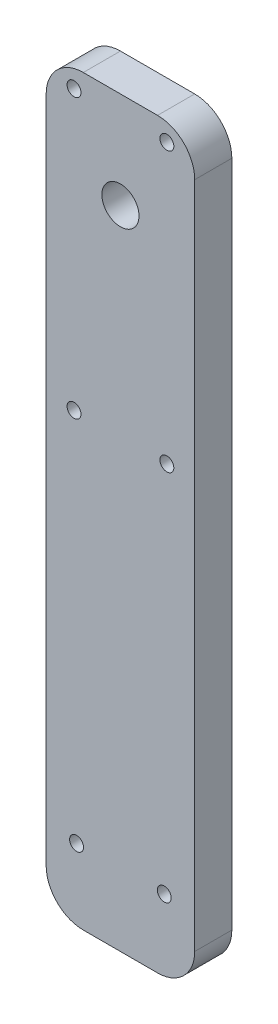
ISO-10303-21;
HEADER;
FILE_DESCRIPTION(('STEP AP214'),'2;1');
FILE_NAME('part.step','',(''),(''),'','','');
FILE_SCHEMA(('AUTOMOTIVE_DESIGN { 1 0 10303 214 1 1 1 1 }'));
ENDSEC;
DATA;
#1=APPLICATION_CONTEXT('core data for automotive mechanical design processes');
#2=APPLICATION_PROTOCOL_DEFINITION('international standard','automotive_design',2000,#1);
#3=PRODUCT_CONTEXT('',#1,'mechanical');
#4=PRODUCT('Part','Part','',(#3));
#5=PRODUCT_RELATED_PRODUCT_CATEGORY('part','',(#4));
#6=PRODUCT_DEFINITION_FORMATION('','',#4);
#7=PRODUCT_DEFINITION_CONTEXT('part definition',#1,'design');
#8=PRODUCT_DEFINITION('design','',#6,#7);
#9=PRODUCT_DEFINITION_SHAPE('','',#8);
#10=(LENGTH_UNIT() NAMED_UNIT(*) SI_UNIT(.MILLI.,.METRE.));
#11=(NAMED_UNIT(*) PLANE_ANGLE_UNIT() SI_UNIT($,.RADIAN.));
#12=(NAMED_UNIT(*) SI_UNIT($,.STERADIAN.) SOLID_ANGLE_UNIT());
#13=UNCERTAINTY_MEASURE_WITH_UNIT(LENGTH_MEASURE(1.E-05),#10,'distance_accuracy_value','');
#14=(GEOMETRIC_REPRESENTATION_CONTEXT(3) GLOBAL_UNCERTAINTY_ASSIGNED_CONTEXT((#13)) GLOBAL_UNIT_ASSIGNED_CONTEXT((#10,
#11,#12)) REPRESENTATION_CONTEXT('',''));
#15=CARTESIAN_POINT('',(0.,0.,0.));
#16=DIRECTION('',(0.,0.,1.));
#17=DIRECTION('',(1.,0.,0.));
#18=AXIS2_PLACEMENT_3D('',#15,#16,#17);
#19=CARTESIAN_POINT('',(0.,0.,6.35));
#20=DIRECTION('',(1.,0.,0.));
#21=DIRECTION('',(0.,0.,-1.));
#22=AXIS2_PLACEMENT_3D('',#19,#20,#21);
#23=PLANE('',#22);
#24=DIRECTION('',(0.,-1.,0.));
#25=VECTOR('',#24,1.);
#26=CARTESIAN_POINT('',(0.,0.,6.35));
#27=LINE('',#26,#25);
#28=CARTESIAN_POINT('',(0.,120.65,6.35));
#29=VERTEX_POINT('',#28);
#30=CARTESIAN_POINT('',(0.,6.35,6.35));
#31=VERTEX_POINT('',#30);
#32=EDGE_CURVE('E118',#29,#31,#27,.T.);
#33=ORIENTED_EDGE('',*,*,#32,.F.);
#34=DIRECTION('',(0.,0.,-1.));
#35=VECTOR('',#34,1.);
#36=CARTESIAN_POINT('',(0.,120.65,6.35));
#37=LINE('',#36,#35);
#38=CARTESIAN_POINT('',(0.,120.65,0.));
#39=VERTEX_POINT('',#38);
#40=EDGE_CURVE('E103',#29,#39,#37,.T.);
#41=ORIENTED_EDGE('',*,*,#40,.T.);
#42=DIRECTION('',(0.,-1.,0.));
#43=VECTOR('',#42,1.);
#44=CARTESIAN_POINT('',(0.,0.,0.));
#45=LINE('',#44,#43);
#46=CARTESIAN_POINT('',(0.,6.35,0.));
#47=VERTEX_POINT('',#46);
#48=EDGE_CURVE('E115',#39,#47,#45,.T.);
#49=ORIENTED_EDGE('',*,*,#48,.T.);
#50=DIRECTION('',(0.,0.,-1.));
#51=VECTOR('',#50,1.);
#52=CARTESIAN_POINT('',(0.,6.35,6.35));
#53=LINE('',#52,#51);
#54=EDGE_CURVE('E120',#47,#31,#53,.F.);
#55=ORIENTED_EDGE('',*,*,#54,.T.);
#56=EDGE_LOOP('',(#33,#41,#49,#55));
#57=FACE_BOUND('',#56,.T.);
#58=ADVANCED_FACE('F32',(#57),#23,.F.);
#59=CARTESIAN_POINT('',(0.,0.,6.35));
#60=DIRECTION('',(0.,1.,0.));
#61=DIRECTION('',(0.,0.,1.));
#62=AXIS2_PLACEMENT_3D('',#59,#60,#61);
#63=PLANE('',#62);
#64=DIRECTION('',(1.,0.,0.));
#65=VECTOR('',#64,1.);
#66=CARTESIAN_POINT('',(0.,0.,6.35));
#67=LINE('',#66,#65);
#68=CARTESIAN_POINT('',(6.35,0.,6.35));
#69=VERTEX_POINT('',#68);
#70=CARTESIAN_POINT('',(19.05,0.,6.35));
#71=VERTEX_POINT('',#70);
#72=EDGE_CURVE('E162',#69,#71,#67,.T.);
#73=ORIENTED_EDGE('',*,*,#72,.F.);
#74=DIRECTION('',(0.,0.,-1.));
#75=VECTOR('',#74,1.);
#76=CARTESIAN_POINT('',(6.35,0.,6.35));
#77=LINE('',#76,#75);
#78=CARTESIAN_POINT('',(6.35,0.,0.));
#79=VERTEX_POINT('',#78);
#80=EDGE_CURVE('E11',#69,#79,#77,.T.);
#81=ORIENTED_EDGE('',*,*,#80,.T.);
#82=DIRECTION('',(1.,0.,0.));
#83=VECTOR('',#82,1.);
#84=CARTESIAN_POINT('',(0.,0.,0.));
#85=LINE('',#84,#83);
#86=CARTESIAN_POINT('',(19.05,0.,0.));
#87=VERTEX_POINT('',#86);
#88=EDGE_CURVE('E125',#79,#87,#85,.T.);
#89=ORIENTED_EDGE('',*,*,#88,.T.);
#90=DIRECTION('',(0.,0.,-1.));
#91=VECTOR('',#90,1.);
#92=CARTESIAN_POINT('',(19.05,0.,6.35));
#93=LINE('',#92,#91);
#94=EDGE_CURVE('E40',#87,#71,#93,.F.);
#95=ORIENTED_EDGE('',*,*,#94,.T.);
#96=EDGE_LOOP('',(#73,#81,#89,#95));
#97=FACE_BOUND('',#96,.T.);
#98=ADVANCED_FACE('F161',(#97),#63,.F.);
#99=CARTESIAN_POINT('',(25.4,0.,6.35));
#100=DIRECTION('',(-1.,0.,0.));
#101=DIRECTION('',(0.,0.,1.));
#102=AXIS2_PLACEMENT_3D('',#99,#100,#101);
#103=PLANE('',#102);
#104=DIRECTION('',(0.,1.,0.));
#105=VECTOR('',#104,1.);
#106=CARTESIAN_POINT('',(25.4,0.,0.));
#107=LINE('',#106,#105);
#108=CARTESIAN_POINT('',(25.4,6.35,0.));
#109=VERTEX_POINT('',#108);
#110=CARTESIAN_POINT('',(25.4,120.65,0.));
#111=VERTEX_POINT('',#110);
#112=EDGE_CURVE('E129',#109,#111,#107,.T.);
#113=ORIENTED_EDGE('',*,*,#112,.T.);
#114=DIRECTION('',(0.,0.,-1.));
#115=VECTOR('',#114,1.);
#116=CARTESIAN_POINT('',(25.4,120.65,6.35));
#117=LINE('',#116,#115);
#118=CARTESIAN_POINT('',(25.4,120.65,6.35));
#119=VERTEX_POINT('',#118);
#120=EDGE_CURVE('E47',#111,#119,#117,.F.);
#121=ORIENTED_EDGE('',*,*,#120,.T.);
#122=DIRECTION('',(0.,1.,0.));
#123=VECTOR('',#122,1.);
#124=CARTESIAN_POINT('',(25.4,0.,6.35));
#125=LINE('',#124,#123);
#126=CARTESIAN_POINT('',(25.4,6.35,6.35));
#127=VERTEX_POINT('',#126);
#128=EDGE_CURVE('E168',#127,#119,#125,.T.);
#129=ORIENTED_EDGE('',*,*,#128,.F.);
#130=DIRECTION('',(0.,0.,-1.));
#131=VECTOR('',#130,1.);
#132=CARTESIAN_POINT('',(25.4,6.35,6.35));
#133=LINE('',#132,#131);
#134=EDGE_CURVE('E155',#127,#109,#133,.T.);
#135=ORIENTED_EDGE('',*,*,#134,.T.);
#136=EDGE_LOOP('',(#113,#121,#129,#135));
#137=FACE_BOUND('',#136,.T.);
#138=ADVANCED_FACE('F172',(#137),#103,.F.);
#139=CARTESIAN_POINT('',(0.,127.,6.35));
#140=DIRECTION('',(0.,-1.,0.));
#141=DIRECTION('',(0.,0.,-1.));
#142=AXIS2_PLACEMENT_3D('',#139,#140,#141);
#143=PLANE('',#142);
#144=DIRECTION('',(-1.,0.,0.));
#145=VECTOR('',#144,1.);
#146=CARTESIAN_POINT('',(0.,127.,0.));
#147=LINE('',#146,#145);
#148=CARTESIAN_POINT('',(19.05,127.,0.));
#149=VERTEX_POINT('',#148);
#150=CARTESIAN_POINT('',(6.35,127.,0.));
#151=VERTEX_POINT('',#150);
#152=EDGE_CURVE('E139',#149,#151,#147,.T.);
#153=ORIENTED_EDGE('',*,*,#152,.T.);
#154=DIRECTION('',(0.,0.,-1.));
#155=VECTOR('',#154,1.);
#156=CARTESIAN_POINT('',(6.35,127.,6.35));
#157=LINE('',#156,#155);
#158=CARTESIAN_POINT('',(6.35,127.,6.35));
#159=VERTEX_POINT('',#158);
#160=EDGE_CURVE('E104',#151,#159,#157,.F.);
#161=ORIENTED_EDGE('',*,*,#160,.T.);
#162=DIRECTION('',(-1.,0.,0.));
#163=VECTOR('',#162,1.);
#164=CARTESIAN_POINT('',(0.,127.,6.35));
#165=LINE('',#164,#163);
#166=CARTESIAN_POINT('',(19.05,127.,6.35));
#167=VERTEX_POINT('',#166);
#168=EDGE_CURVE('E135',#167,#159,#165,.T.);
#169=ORIENTED_EDGE('',*,*,#168,.F.);
#170=DIRECTION('',(0.,0.,-1.));
#171=VECTOR('',#170,1.);
#172=CARTESIAN_POINT('',(19.05,127.,6.35));
#173=LINE('',#172,#171);
#174=EDGE_CURVE('E109',#167,#149,#173,.T.);
#175=ORIENTED_EDGE('',*,*,#174,.T.);
#176=EDGE_LOOP('',(#153,#161,#169,#175));
#177=FACE_BOUND('',#176,.T.);
#178=ADVANCED_FACE('F179',(#177),#143,.F.);
#179=CARTESIAN_POINT('',(0.,0.,6.35));
#180=DIRECTION('',(0.,0.,-1.));
#181=DIRECTION('',(-1.,0.,0.));
#182=AXIS2_PLACEMENT_3D('',#179,#180,#181);
#183=PLANE('',#182);
#184=CARTESIAN_POINT('',(4.7625,76.1873,6.35));
#185=DIRECTION('',(0.,0.,1.));
#186=DIRECTION('',(1.,0.,0.));
#187=AXIS2_PLACEMENT_3D('',#184,#185,#186);
#188=CIRCLE('',#187,1.190625);
#189=CARTESIAN_POINT('',(5.953125,76.1873,6.35));
#190=VERTEX_POINT('',#189);
#191=EDGE_CURVE('E207',#190,#190,#188,.T.);
#192=ORIENTED_EDGE('',*,*,#191,.F.);
#193=EDGE_LOOP('',(#192));
#194=FACE_BOUND('',#193,.T.);
#195=CARTESIAN_POINT('',(20.6375,76.1873,6.35));
#196=DIRECTION('',(0.,0.,1.));
#197=DIRECTION('',(1.,0.,0.));
#198=AXIS2_PLACEMENT_3D('',#195,#196,#197);
#199=CIRCLE('',#198,1.190625);
#200=CARTESIAN_POINT('',(21.828125,76.1873,6.35));
#201=VERTEX_POINT('',#200);
#202=EDGE_CURVE('E206',#201,#201,#199,.T.);
#203=ORIENTED_EDGE('',*,*,#202,.F.);
#204=EDGE_LOOP('',(#203));
#205=FACE_BOUND('',#204,.T.);
#206=CARTESIAN_POINT('',(20.6375,123.8123,6.35));
#207=DIRECTION('',(0.,0.,1.));
#208=DIRECTION('',(1.,0.,0.));
#209=AXIS2_PLACEMENT_3D('',#206,#207,#208);
#210=CIRCLE('',#209,1.190625);
#211=CARTESIAN_POINT('',(21.828125,123.8123,6.35));
#212=VERTEX_POINT('',#211);
#213=EDGE_CURVE('E213',#212,#212,#210,.T.);
#214=ORIENTED_EDGE('',*,*,#213,.F.);
#215=EDGE_LOOP('',(#214));
#216=FACE_BOUND('',#215,.T.);
#217=CARTESIAN_POINT('',(4.7625,123.8123,6.35));
#218=DIRECTION('',(0.,0.,1.));
#219=DIRECTION('',(1.,0.,0.));
#220=AXIS2_PLACEMENT_3D('',#217,#218,#219);
#221=CIRCLE('',#220,1.190625);
#222=CARTESIAN_POINT('',(5.953125,123.8123,6.35));
#223=VERTEX_POINT('',#222);
#224=EDGE_CURVE('E199',#223,#223,#221,.T.);
#225=ORIENTED_EDGE('',*,*,#224,.F.);
#226=EDGE_LOOP('',(#225));
#227=FACE_BOUND('',#226,.T.);
#228=CARTESIAN_POINT('',(12.7,110.49991,6.35));
#229=DIRECTION('',(0.,0.,1.));
#230=DIRECTION('',(1.,0.,0.));
#231=AXIS2_PLACEMENT_3D('',#228,#229,#230);
#232=CIRCLE('',#231,3.175);
#233=CARTESIAN_POINT('',(15.875,110.49991,6.35));
#234=VERTEX_POINT('',#233);
#235=EDGE_CURVE('E193',#234,#234,#232,.T.);
#236=ORIENTED_EDGE('',*,*,#235,.F.);
#237=EDGE_LOOP('',(#236));
#238=FACE_BOUND('',#237,.T.);
#239=CARTESIAN_POINT('',(5.2,12.2625,6.35));
#240=DIRECTION('',(0.,0.,1.));
#241=DIRECTION('',(1.,0.,0.));
#242=AXIS2_PLACEMENT_3D('',#239,#240,#241);
#243=CIRCLE('',#242,1.190625);
#244=CARTESIAN_POINT('',(6.390625,12.2625,6.35));
#245=VERTEX_POINT('',#244);
#246=EDGE_CURVE('E132',#245,#245,#243,.T.);
#247=ORIENTED_EDGE('',*,*,#246,.F.);
#248=EDGE_LOOP('',(#247));
#249=FACE_BOUND('',#248,.T.);
#250=CARTESIAN_POINT('',(20.2,12.2625,6.35));
#251=DIRECTION('',(0.,0.,1.));
#252=DIRECTION('',(1.,0.,0.));
#253=AXIS2_PLACEMENT_3D('',#250,#251,#252);
#254=CIRCLE('',#253,1.190625);
#255=CARTESIAN_POINT('',(21.390625,12.2625,6.35));
#256=VERTEX_POINT('',#255);
#257=EDGE_CURVE('E185',#256,#256,#254,.T.);
#258=ORIENTED_EDGE('',*,*,#257,.F.);
#259=EDGE_LOOP('',(#258));
#260=FACE_BOUND('',#259,.T.);
#261=ORIENTED_EDGE('',*,*,#168,.T.);
#262=CARTESIAN_POINT('',(6.35,120.65,6.35));
#263=DIRECTION('',(0.,0.,-1.));
#264=DIRECTION('',(-1.,0.,0.));
#265=AXIS2_PLACEMENT_3D('',#262,#263,#264);
#266=CIRCLE('',#265,6.35);
#267=EDGE_CURVE('E153',#159,#29,#266,.F.);
#268=ORIENTED_EDGE('',*,*,#267,.T.);
#269=ORIENTED_EDGE('',*,*,#32,.T.);
#270=CARTESIAN_POINT('',(6.35,6.35,6.35));
#271=DIRECTION('',(0.,0.,-1.));
#272=DIRECTION('',(-1.,0.,0.));
#273=AXIS2_PLACEMENT_3D('',#270,#271,#272);
#274=CIRCLE('',#273,6.35);
#275=EDGE_CURVE('E149',#31,#69,#274,.F.);
#276=ORIENTED_EDGE('',*,*,#275,.T.);
#277=ORIENTED_EDGE('',*,*,#72,.T.);
#278=CARTESIAN_POINT('',(19.05,6.35,6.35));
#279=DIRECTION('',(0.,0.,-1.));
#280=DIRECTION('',(-1.,0.,0.));
#281=AXIS2_PLACEMENT_3D('',#278,#279,#280);
#282=CIRCLE('',#281,6.35);
#283=EDGE_CURVE('E54',#71,#127,#282,.F.);
#284=ORIENTED_EDGE('',*,*,#283,.T.);
#285=ORIENTED_EDGE('',*,*,#128,.T.);
#286=CARTESIAN_POINT('',(19.05,120.65,6.35));
#287=DIRECTION('',(0.,0.,-1.));
#288=DIRECTION('',(-1.,0.,0.));
#289=AXIS2_PLACEMENT_3D('',#286,#287,#288);
#290=CIRCLE('',#289,6.35);
#291=EDGE_CURVE('E151',#119,#167,#290,.F.);
#292=ORIENTED_EDGE('',*,*,#291,.T.);
#293=EDGE_LOOP('',(#261,#268,#269,#276,#277,#284,#285,#292));
#294=FACE_BOUND('',#293,.T.);
#295=ADVANCED_FACE('F166',(#194,#205,#216,#227,#238,#249,#260,#294),#183,.F.);
#296=CARTESIAN_POINT('',(0.,0.,0.));
#297=DIRECTION('',(0.,0.,-1.));
#298=DIRECTION('',(-1.,0.,0.));
#299=AXIS2_PLACEMENT_3D('',#296,#297,#298);
#300=PLANE('',#299);
#301=CARTESIAN_POINT('',(4.7625,76.1873,0.));
#302=DIRECTION('',(0.,0.,-1.));
#303=DIRECTION('',(-1.,0.,0.));
#304=AXIS2_PLACEMENT_3D('',#301,#302,#303);
#305=CIRCLE('',#304,1.190625);
#306=CARTESIAN_POINT('',(3.571875,76.1873,0.));
#307=VERTEX_POINT('',#306);
#308=EDGE_CURVE('E203',#307,#307,#305,.F.);
#309=ORIENTED_EDGE('',*,*,#308,.T.);
#310=EDGE_LOOP('',(#309));
#311=FACE_BOUND('',#310,.T.);
#312=CARTESIAN_POINT('',(20.6375,76.1873,0.));
#313=DIRECTION('',(0.,0.,-1.));
#314=DIRECTION('',(-1.,0.,0.));
#315=AXIS2_PLACEMENT_3D('',#312,#313,#314);
#316=CIRCLE('',#315,1.190625);
#317=CARTESIAN_POINT('',(19.446875,76.1873,0.));
#318=VERTEX_POINT('',#317);
#319=EDGE_CURVE('E210',#318,#318,#316,.F.);
#320=ORIENTED_EDGE('',*,*,#319,.T.);
#321=EDGE_LOOP('',(#320));
#322=FACE_BOUND('',#321,.T.);
#323=CARTESIAN_POINT('',(20.6375,123.8123,0.));
#324=DIRECTION('',(0.,0.,-1.));
#325=DIRECTION('',(-1.,0.,0.));
#326=AXIS2_PLACEMENT_3D('',#323,#324,#325);
#327=CIRCLE('',#326,1.190625);
#328=CARTESIAN_POINT('',(19.446875,123.8123,0.));
#329=VERTEX_POINT('',#328);
#330=EDGE_CURVE('E202',#329,#329,#327,.F.);
#331=ORIENTED_EDGE('',*,*,#330,.T.);
#332=EDGE_LOOP('',(#331));
#333=FACE_BOUND('',#332,.T.);
#334=CARTESIAN_POINT('',(4.7625,123.8123,0.));
#335=DIRECTION('',(0.,0.,-1.));
#336=DIRECTION('',(-1.,0.,0.));
#337=AXIS2_PLACEMENT_3D('',#334,#335,#336);
#338=CIRCLE('',#337,1.190625);
#339=CARTESIAN_POINT('',(3.571875,123.8123,0.));
#340=VERTEX_POINT('',#339);
#341=EDGE_CURVE('E196',#340,#340,#338,.F.);
#342=ORIENTED_EDGE('',*,*,#341,.T.);
#343=EDGE_LOOP('',(#342));
#344=FACE_BOUND('',#343,.T.);
#345=CARTESIAN_POINT('',(12.7,110.49991,0.));
#346=DIRECTION('',(0.,0.,-1.));
#347=DIRECTION('',(-1.,0.,0.));
#348=AXIS2_PLACEMENT_3D('',#345,#346,#347);
#349=CIRCLE('',#348,3.175);
#350=CARTESIAN_POINT('',(9.525,110.49991,0.));
#351=VERTEX_POINT('',#350);
#352=EDGE_CURVE('E187',#351,#351,#349,.F.);
#353=ORIENTED_EDGE('',*,*,#352,.T.);
#354=EDGE_LOOP('',(#353));
#355=FACE_BOUND('',#354,.T.);
#356=CARTESIAN_POINT('',(5.2,12.2625,0.));
#357=DIRECTION('',(0.,0.,-1.));
#358=DIRECTION('',(-1.,0.,0.));
#359=AXIS2_PLACEMENT_3D('',#356,#357,#358);
#360=CIRCLE('',#359,1.190625);
#361=CARTESIAN_POINT('',(4.009375,12.2625,0.));
#362=VERTEX_POINT('',#361);
#363=EDGE_CURVE('E126',#362,#362,#360,.F.);
#364=ORIENTED_EDGE('',*,*,#363,.T.);
#365=EDGE_LOOP('',(#364));
#366=FACE_BOUND('',#365,.T.);
#367=CARTESIAN_POINT('',(20.2,12.2625,0.));
#368=DIRECTION('',(0.,0.,-1.));
#369=DIRECTION('',(-1.,0.,0.));
#370=AXIS2_PLACEMENT_3D('',#367,#368,#369);
#371=CIRCLE('',#370,1.190625);
#372=CARTESIAN_POINT('',(19.009375,12.2625,0.));
#373=VERTEX_POINT('',#372);
#374=EDGE_CURVE('E182',#373,#373,#371,.F.);
#375=ORIENTED_EDGE('',*,*,#374,.T.);
#376=EDGE_LOOP('',(#375));
#377=FACE_BOUND('',#376,.T.);
#378=ORIENTED_EDGE('',*,*,#48,.F.);
#379=CARTESIAN_POINT('',(6.35,120.65,0.));
#380=DIRECTION('',(0.,0.,-1.));
#381=DIRECTION('',(-1.,0.,0.));
#382=AXIS2_PLACEMENT_3D('',#379,#380,#381);
#383=CIRCLE('',#382,6.35);
#384=EDGE_CURVE('E99',#39,#151,#383,.T.);
#385=ORIENTED_EDGE('',*,*,#384,.T.);
#386=ORIENTED_EDGE('',*,*,#152,.F.);
#387=CARTESIAN_POINT('',(19.05,120.65,0.));
#388=DIRECTION('',(0.,0.,-1.));
#389=DIRECTION('',(-1.,0.,0.));
#390=AXIS2_PLACEMENT_3D('',#387,#388,#389);
#391=CIRCLE('',#390,6.35);
#392=EDGE_CURVE('E110',#149,#111,#391,.T.);
#393=ORIENTED_EDGE('',*,*,#392,.T.);
#394=ORIENTED_EDGE('',*,*,#112,.F.);
#395=CARTESIAN_POINT('',(19.05,6.35,0.));
#396=DIRECTION('',(0.,0.,-1.));
#397=DIRECTION('',(-1.,0.,0.));
#398=AXIS2_PLACEMENT_3D('',#395,#396,#397);
#399=CIRCLE('',#398,6.35);
#400=EDGE_CURVE('E119',#109,#87,#399,.T.);
#401=ORIENTED_EDGE('',*,*,#400,.T.);
#402=ORIENTED_EDGE('',*,*,#88,.F.);
#403=CARTESIAN_POINT('',(6.35,6.35,0.));
#404=DIRECTION('',(0.,0.,-1.));
#405=DIRECTION('',(-1.,0.,0.));
#406=AXIS2_PLACEMENT_3D('',#403,#404,#405);
#407=CIRCLE('',#406,6.35);
#408=EDGE_CURVE('E124',#79,#47,#407,.T.);
#409=ORIENTED_EDGE('',*,*,#408,.T.);
#410=EDGE_LOOP('',(#378,#385,#386,#393,#394,#401,#402,#409));
#411=FACE_BOUND('',#410,.T.);
#412=ADVANCED_FACE('F122',(#311,#322,#333,#344,#355,#366,#377,#411),#300,.T.);
#413=CARTESIAN_POINT('',(20.2,12.2625,-3.36759604540093));
#414=DIRECTION('',(0.,0.,1.));
#415=DIRECTION('',(1.,0.,0.));
#416=AXIS2_PLACEMENT_3D('',#413,#414,#415);
#417=CYLINDRICAL_SURFACE('',#416,1.190625);
#418=ORIENTED_EDGE('',*,*,#257,.T.);
#419=EDGE_LOOP('',(#418));
#420=FACE_BOUND('',#419,.T.);
#421=ORIENTED_EDGE('',*,*,#374,.F.);
#422=EDGE_LOOP('',(#421));
#423=FACE_BOUND('',#422,.T.);
#424=ADVANCED_FACE('F236',(#420,#423),#417,.F.);
#425=CARTESIAN_POINT('',(5.2,12.2625,-3.36759604540093));
#426=DIRECTION('',(0.,0.,1.));
#427=DIRECTION('',(1.,0.,0.));
#428=AXIS2_PLACEMENT_3D('',#425,#426,#427);
#429=CYLINDRICAL_SURFACE('',#428,1.190625);
#430=ORIENTED_EDGE('',*,*,#246,.T.);
#431=EDGE_LOOP('',(#430));
#432=FACE_BOUND('',#431,.T.);
#433=ORIENTED_EDGE('',*,*,#363,.F.);
#434=EDGE_LOOP('',(#433));
#435=FACE_BOUND('',#434,.T.);
#436=ADVANCED_FACE('F239',(#432,#435),#429,.F.);
#437=CARTESIAN_POINT('',(6.35,120.65,6.35));
#438=DIRECTION('',(0.,0.,-1.));
#439=DIRECTION('',(-1.,0.,0.));
#440=AXIS2_PLACEMENT_3D('',#437,#438,#439);
#441=CYLINDRICAL_SURFACE('',#440,6.35);
#442=ORIENTED_EDGE('',*,*,#267,.F.);
#443=ORIENTED_EDGE('',*,*,#160,.F.);
#444=ORIENTED_EDGE('',*,*,#384,.F.);
#445=ORIENTED_EDGE('',*,*,#40,.F.);
#446=EDGE_LOOP('',(#442,#443,#444,#445));
#447=FACE_BOUND('',#446,.T.);
#448=ADVANCED_FACE('F102',(#447),#441,.T.);
#449=CARTESIAN_POINT('',(19.05,120.65,6.35));
#450=DIRECTION('',(0.,0.,-1.));
#451=DIRECTION('',(-1.,0.,0.));
#452=AXIS2_PLACEMENT_3D('',#449,#450,#451);
#453=CYLINDRICAL_SURFACE('',#452,6.35);
#454=ORIENTED_EDGE('',*,*,#291,.F.);
#455=ORIENTED_EDGE('',*,*,#120,.F.);
#456=ORIENTED_EDGE('',*,*,#392,.F.);
#457=ORIENTED_EDGE('',*,*,#174,.F.);
#458=EDGE_LOOP('',(#454,#455,#456,#457));
#459=FACE_BOUND('',#458,.T.);
#460=ADVANCED_FACE('F176',(#459),#453,.T.);
#461=CARTESIAN_POINT('',(6.35,6.35,6.35));
#462=DIRECTION('',(0.,0.,-1.));
#463=DIRECTION('',(-1.,0.,0.));
#464=AXIS2_PLACEMENT_3D('',#461,#462,#463);
#465=CYLINDRICAL_SURFACE('',#464,6.35);
#466=ORIENTED_EDGE('',*,*,#275,.F.);
#467=ORIENTED_EDGE('',*,*,#54,.F.);
#468=ORIENTED_EDGE('',*,*,#408,.F.);
#469=ORIENTED_EDGE('',*,*,#80,.F.);
#470=EDGE_LOOP('',(#466,#467,#468,#469));
#471=FACE_BOUND('',#470,.T.);
#472=ADVANCED_FACE('F261',(#471),#465,.T.);
#473=CARTESIAN_POINT('',(19.05,6.35,6.35));
#474=DIRECTION('',(0.,0.,-1.));
#475=DIRECTION('',(-1.,0.,0.));
#476=AXIS2_PLACEMENT_3D('',#473,#474,#475);
#477=CYLINDRICAL_SURFACE('',#476,6.35);
#478=ORIENTED_EDGE('',*,*,#283,.F.);
#479=ORIENTED_EDGE('',*,*,#94,.F.);
#480=ORIENTED_EDGE('',*,*,#400,.F.);
#481=ORIENTED_EDGE('',*,*,#134,.F.);
#482=EDGE_LOOP('',(#478,#479,#480,#481));
#483=FACE_BOUND('',#482,.T.);
#484=ADVANCED_FACE('F34',(#483),#477,.T.);
#485=CARTESIAN_POINT('',(12.7,110.49991,-8.98025612106915));
#486=DIRECTION('',(0.,0.,1.));
#487=DIRECTION('',(1.,0.,0.));
#488=AXIS2_PLACEMENT_3D('',#485,#486,#487);
#489=CYLINDRICAL_SURFACE('',#488,3.175);
#490=ORIENTED_EDGE('',*,*,#235,.T.);
#491=EDGE_LOOP('',(#490));
#492=FACE_BOUND('',#491,.T.);
#493=ORIENTED_EDGE('',*,*,#352,.F.);
#494=EDGE_LOOP('',(#493));
#495=FACE_BOUND('',#494,.T.);
#496=ADVANCED_FACE('F267',(#492,#495),#489,.F.);
#497=CARTESIAN_POINT('',(4.7625,123.8123,-3.36759604540093));
#498=DIRECTION('',(0.,0.,1.));
#499=DIRECTION('',(1.,0.,0.));
#500=AXIS2_PLACEMENT_3D('',#497,#498,#499);
#501=CYLINDRICAL_SURFACE('',#500,1.190625);
#502=ORIENTED_EDGE('',*,*,#224,.T.);
#503=EDGE_LOOP('',(#502));
#504=FACE_BOUND('',#503,.T.);
#505=ORIENTED_EDGE('',*,*,#341,.F.);
#506=EDGE_LOOP('',(#505));
#507=FACE_BOUND('',#506,.T.);
#508=ADVANCED_FACE('F271',(#504,#507),#501,.F.);
#509=CARTESIAN_POINT('',(20.6375,123.8123,-3.36759604540093));
#510=DIRECTION('',(0.,0.,1.));
#511=DIRECTION('',(1.,0.,0.));
#512=AXIS2_PLACEMENT_3D('',#509,#510,#511);
#513=CYLINDRICAL_SURFACE('',#512,1.190625);
#514=ORIENTED_EDGE('',*,*,#213,.T.);
#515=EDGE_LOOP('',(#514));
#516=FACE_BOUND('',#515,.T.);
#517=ORIENTED_EDGE('',*,*,#330,.F.);
#518=EDGE_LOOP('',(#517));
#519=FACE_BOUND('',#518,.T.);
#520=ADVANCED_FACE('F221',(#516,#519),#513,.F.);
#521=CARTESIAN_POINT('',(20.6375,76.1873,-3.36759604540093));
#522=DIRECTION('',(0.,0.,1.));
#523=DIRECTION('',(1.,0.,0.));
#524=AXIS2_PLACEMENT_3D('',#521,#522,#523);
#525=CYLINDRICAL_SURFACE('',#524,1.190625);
#526=ORIENTED_EDGE('',*,*,#202,.T.);
#527=EDGE_LOOP('',(#526));
#528=FACE_BOUND('',#527,.T.);
#529=ORIENTED_EDGE('',*,*,#319,.F.);
#530=EDGE_LOOP('',(#529));
#531=FACE_BOUND('',#530,.T.);
#532=ADVANCED_FACE('F340',(#528,#531),#525,.F.);
#533=CARTESIAN_POINT('',(4.7625,76.1873,-3.36759604540093));
#534=DIRECTION('',(0.,0.,1.));
#535=DIRECTION('',(1.,0.,0.));
#536=AXIS2_PLACEMENT_3D('',#533,#534,#535);
#537=CYLINDRICAL_SURFACE('',#536,1.190625);
#538=ORIENTED_EDGE('',*,*,#191,.T.);
#539=EDGE_LOOP('',(#538));
#540=FACE_BOUND('',#539,.T.);
#541=ORIENTED_EDGE('',*,*,#308,.F.);
#542=EDGE_LOOP('',(#541));
#543=FACE_BOUND('',#542,.T.);
#544=ADVANCED_FACE('F349',(#540,#543),#537,.F.);
#545=CLOSED_SHELL('',(#58,#98,#138,#178,#295,#412,#424,#436,#448,#460,#472,#484,#496,#508,#520,
#532,#544));
#546=MANIFOLD_SOLID_BREP('B2',#545);
#547=ADVANCED_BREP_SHAPE_REPRESENTATION('',(#18,#546),#14);
#548=SHAPE_DEFINITION_REPRESENTATION(#9,#547);
ENDSEC;
END-ISO-10303-21;
